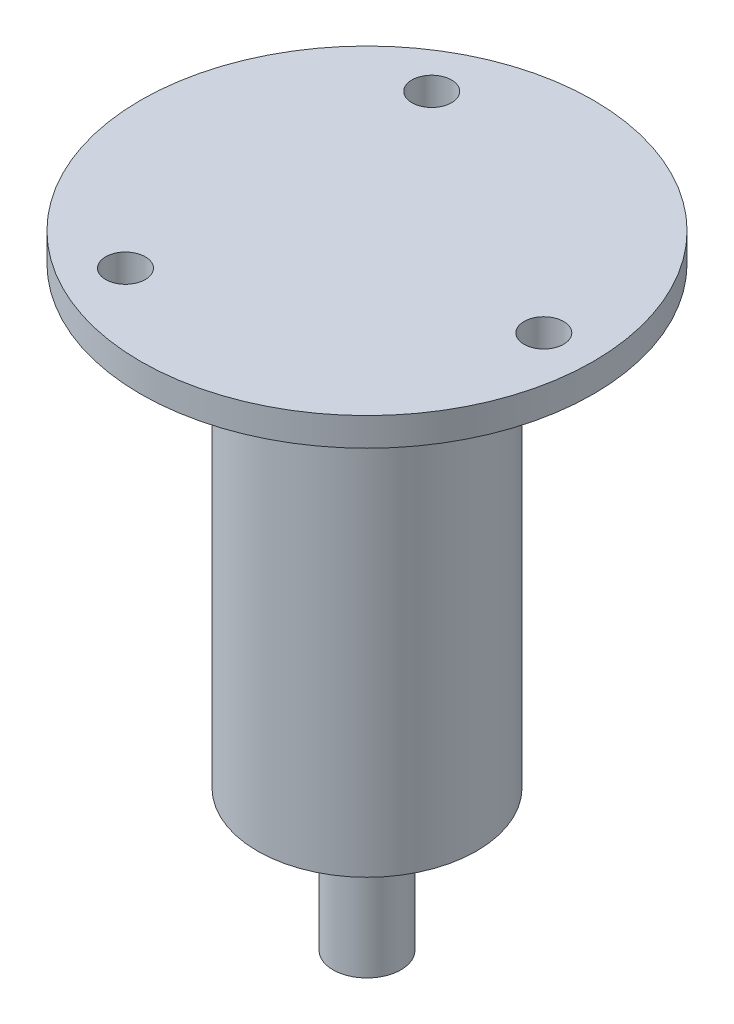
ISO-10303-21;
HEADER;
FILE_DESCRIPTION(('STEP AP214'),'2;1');
FILE_NAME('part.step','',(''),(''),'','','');
FILE_SCHEMA(('AUTOMOTIVE_DESIGN { 1 0 10303 214 1 1 1 1 }'));
ENDSEC;
DATA;
#1=APPLICATION_CONTEXT('core data for automotive mechanical design processes');
#2=APPLICATION_PROTOCOL_DEFINITION('international standard','automotive_design',2000,#1);
#3=PRODUCT_CONTEXT('',#1,'mechanical');
#4=PRODUCT('Part','Part','',(#3));
#5=PRODUCT_RELATED_PRODUCT_CATEGORY('part','',(#4));
#6=PRODUCT_DEFINITION_FORMATION('','',#4);
#7=PRODUCT_DEFINITION_CONTEXT('part definition',#1,'design');
#8=PRODUCT_DEFINITION('design','',#6,#7);
#9=PRODUCT_DEFINITION_SHAPE('','',#8);
#10=(LENGTH_UNIT() NAMED_UNIT(*) SI_UNIT(.MILLI.,.METRE.));
#11=(NAMED_UNIT(*) PLANE_ANGLE_UNIT() SI_UNIT($,.RADIAN.));
#12=(NAMED_UNIT(*) SI_UNIT($,.STERADIAN.) SOLID_ANGLE_UNIT());
#13=UNCERTAINTY_MEASURE_WITH_UNIT(LENGTH_MEASURE(1.E-05),#10,'distance_accuracy_value','');
#14=(GEOMETRIC_REPRESENTATION_CONTEXT(3) GLOBAL_UNCERTAINTY_ASSIGNED_CONTEXT((#13)) GLOBAL_UNIT_ASSIGNED_CONTEXT((#10,
#11,#12)) REPRESENTATION_CONTEXT('',''));
#15=CARTESIAN_POINT('',(0.,0.,0.));
#16=DIRECTION('',(0.,0.,1.));
#17=DIRECTION('',(1.,0.,0.));
#18=AXIS2_PLACEMENT_3D('',#15,#16,#17);
#19=CARTESIAN_POINT('',(0.,14.05,16.));
#20=DIRECTION('',(0.,1.,0.));
#21=DIRECTION('',(0.,0.,1.));
#22=AXIS2_PLACEMENT_3D('',#19,#20,#21);
#23=PLANE('',#22);
#24=CARTESIAN_POINT('',(12.5,14.05,0.));
#25=DIRECTION('',(0.,1.,0.));
#26=DIRECTION('',(0.,0.,1.));
#27=AXIS2_PLACEMENT_3D('',#24,#25,#26);
#28=CIRCLE('',#27,1.4);
#29=CARTESIAN_POINT('',(12.5,14.05,1.39999999999999));
#30=VERTEX_POINT('',#29);
#31=EDGE_CURVE('E63',#30,#30,#28,.T.);
#32=ORIENTED_EDGE('',*,*,#31,.F.);
#33=EDGE_LOOP('',(#32));
#34=FACE_BOUND('',#33,.T.);
#35=CARTESIAN_POINT('',(-6.24999999999998,14.05,10.8253175473055));
#36=DIRECTION('',(0.,1.,0.));
#37=DIRECTION('',(0.,0.,1.));
#38=AXIS2_PLACEMENT_3D('',#35,#36,#37);
#39=CIRCLE('',#38,1.4);
#40=CARTESIAN_POINT('',(-6.24999999999998,14.05,12.2253175473055));
#41=VERTEX_POINT('',#40);
#42=EDGE_CURVE('E50',#41,#41,#39,.T.);
#43=ORIENTED_EDGE('',*,*,#42,.F.);
#44=EDGE_LOOP('',(#43));
#45=FACE_BOUND('',#44,.T.);
#46=CARTESIAN_POINT('',(-6.25000000000001,14.05,-10.8253175473055));
#47=DIRECTION('',(0.,1.,0.));
#48=DIRECTION('',(0.,0.,1.));
#49=AXIS2_PLACEMENT_3D('',#46,#47,#48);
#50=CIRCLE('',#49,1.4);
#51=CARTESIAN_POINT('',(-6.25000000000001,14.05,-9.42531754730548));
#52=VERTEX_POINT('',#51);
#53=EDGE_CURVE('E45',#52,#52,#50,.T.);
#54=ORIENTED_EDGE('',*,*,#53,.F.);
#55=EDGE_LOOP('',(#54));
#56=FACE_BOUND('',#55,.T.);
#57=CARTESIAN_POINT('',(0.,14.05,0.));
#58=DIRECTION('',(0.,1.,0.));
#59=DIRECTION('',(0.,0.,1.));
#60=AXIS2_PLACEMENT_3D('',#57,#58,#59);
#61=CIRCLE('',#60,16.);
#62=CARTESIAN_POINT('',(0.,14.05,16.));
#63=VERTEX_POINT('',#62);
#64=EDGE_CURVE('E64',#63,#63,#61,.T.);
#65=ORIENTED_EDGE('',*,*,#64,.T.);
#66=EDGE_LOOP('',(#65));
#67=FACE_BOUND('',#66,.T.);
#68=ADVANCED_FACE('F35',(#34,#45,#56,#67),#23,.T.);
#69=CARTESIAN_POINT('',(0.,-30.,0.));
#70=DIRECTION('',(0.,1.,0.));
#71=DIRECTION('',(0.,0.,1.));
#72=AXIS2_PLACEMENT_3D('',#69,#70,#71);
#73=PLANE('',#72);
#74=CARTESIAN_POINT('',(0.,-30.,0.));
#75=DIRECTION('',(0.,1.,0.));
#76=DIRECTION('',(0.,0.,1.));
#77=AXIS2_PLACEMENT_3D('',#74,#75,#76);
#78=CIRCLE('',#77,2.4);
#79=CARTESIAN_POINT('',(0.,-30.,2.4));
#80=VERTEX_POINT('',#79);
#81=EDGE_CURVE('E11',#80,#80,#78,.T.);
#82=ORIENTED_EDGE('',*,*,#81,.F.);
#83=EDGE_LOOP('',(#82));
#84=FACE_BOUND('',#83,.T.);
#85=ADVANCED_FACE('F84',(#84),#73,.F.);
#86=CARTESIAN_POINT('',(0.,-30.,0.));
#87=DIRECTION('',(0.,1.,0.));
#88=DIRECTION('',(0.,0.,1.));
#89=AXIS2_PLACEMENT_3D('',#86,#87,#88);
#90=CYLINDRICAL_SURFACE('',#89,2.4);
#91=ORIENTED_EDGE('',*,*,#81,.T.);
#92=EDGE_LOOP('',(#91));
#93=FACE_BOUND('',#92,.T.);
#94=CARTESIAN_POINT('',(0.,-20.05,0.));
#95=DIRECTION('',(0.,1.,0.));
#96=DIRECTION('',(0.,0.,1.));
#97=AXIS2_PLACEMENT_3D('',#94,#95,#96);
#98=CIRCLE('',#97,2.4);
#99=CARTESIAN_POINT('',(0.,-20.05,2.4));
#100=VERTEX_POINT('',#99);
#101=EDGE_CURVE('E41',#100,#100,#98,.T.);
#102=ORIENTED_EDGE('',*,*,#101,.F.);
#103=EDGE_LOOP('',(#102));
#104=FACE_BOUND('',#103,.T.);
#105=ADVANCED_FACE('F113',(#93,#104),#90,.T.);
#106=CARTESIAN_POINT('',(0.,-20.05,-7.75000000000001));
#107=DIRECTION('',(0.,1.,0.));
#108=DIRECTION('',(0.,0.,1.));
#109=AXIS2_PLACEMENT_3D('',#106,#107,#108);
#110=PLANE('',#109);
#111=ORIENTED_EDGE('',*,*,#101,.T.);
#112=EDGE_LOOP('',(#111));
#113=FACE_BOUND('',#112,.T.);
#114=CARTESIAN_POINT('',(0.,-20.05,0.));
#115=DIRECTION('',(0.,1.,0.));
#116=DIRECTION('',(0.,0.,1.));
#117=AXIS2_PLACEMENT_3D('',#114,#115,#116);
#118=CIRCLE('',#117,7.75000000000001);
#119=CARTESIAN_POINT('',(0.,-20.05,7.75000000000001));
#120=VERTEX_POINT('',#119);
#121=EDGE_CURVE('E57',#120,#120,#118,.T.);
#122=ORIENTED_EDGE('',*,*,#121,.F.);
#123=EDGE_LOOP('',(#122));
#124=FACE_BOUND('',#123,.T.);
#125=ADVANCED_FACE('F108',(#113,#124),#110,.F.);
#126=CARTESIAN_POINT('',(0.,23.9311224489796,0.));
#127=DIRECTION('',(0.,1.,0.));
#128=DIRECTION('',(0.,0.,1.));
#129=AXIS2_PLACEMENT_3D('',#126,#127,#128);
#130=CYLINDRICAL_SURFACE('',#129,7.75);
#131=CARTESIAN_POINT('',(0.,12.05,0.));
#132=DIRECTION('',(0.,1.,0.));
#133=DIRECTION('',(0.,0.,1.));
#134=AXIS2_PLACEMENT_3D('',#131,#132,#133);
#135=CIRCLE('',#134,7.75);
#136=CARTESIAN_POINT('',(0.,12.05,7.75));
#137=VERTEX_POINT('',#136);
#138=EDGE_CURVE('E70',#137,#137,#135,.T.);
#139=ORIENTED_EDGE('',*,*,#138,.F.);
#140=EDGE_LOOP('',(#139));
#141=FACE_BOUND('',#140,.T.);
#142=ORIENTED_EDGE('',*,*,#121,.T.);
#143=EDGE_LOOP('',(#142));
#144=FACE_BOUND('',#143,.T.);
#145=ADVANCED_FACE('F101',(#141,#144),#130,.T.);
#146=CARTESIAN_POINT('',(0.,12.05,-16.));
#147=DIRECTION('',(0.,1.,0.));
#148=DIRECTION('',(0.,0.,1.));
#149=AXIS2_PLACEMENT_3D('',#146,#147,#148);
#150=PLANE('',#149);
#151=CARTESIAN_POINT('',(12.5,12.05,0.));
#152=DIRECTION('',(0.,1.,0.));
#153=DIRECTION('',(0.,0.,1.));
#154=AXIS2_PLACEMENT_3D('',#151,#152,#153);
#155=CIRCLE('',#154,1.4);
#156=CARTESIAN_POINT('',(12.5,12.05,1.39999999999999));
#157=VERTEX_POINT('',#156);
#158=EDGE_CURVE('E53',#157,#157,#155,.T.);
#159=ORIENTED_EDGE('',*,*,#158,.T.);
#160=EDGE_LOOP('',(#159));
#161=FACE_BOUND('',#160,.T.);
#162=CARTESIAN_POINT('',(-6.24999999999998,12.05,10.8253175473055));
#163=DIRECTION('',(0.,1.,0.));
#164=DIRECTION('',(0.,0.,1.));
#165=AXIS2_PLACEMENT_3D('',#162,#163,#164);
#166=CIRCLE('',#165,1.4);
#167=CARTESIAN_POINT('',(-6.24999999999998,12.05,12.2253175473055));
#168=VERTEX_POINT('',#167);
#169=EDGE_CURVE('E56',#168,#168,#166,.T.);
#170=ORIENTED_EDGE('',*,*,#169,.T.);
#171=EDGE_LOOP('',(#170));
#172=FACE_BOUND('',#171,.T.);
#173=CARTESIAN_POINT('',(-6.25000000000001,12.05,-10.8253175473055));
#174=DIRECTION('',(0.,1.,0.));
#175=DIRECTION('',(0.,0.,1.));
#176=AXIS2_PLACEMENT_3D('',#173,#174,#175);
#177=CIRCLE('',#176,1.4);
#178=CARTESIAN_POINT('',(-6.25000000000001,12.05,-9.42531754730548));
#179=VERTEX_POINT('',#178);
#180=EDGE_CURVE('E60',#179,#179,#177,.T.);
#181=ORIENTED_EDGE('',*,*,#180,.T.);
#182=EDGE_LOOP('',(#181));
#183=FACE_BOUND('',#182,.T.);
#184=CARTESIAN_POINT('',(0.,12.05,0.));
#185=DIRECTION('',(0.,1.,0.));
#186=DIRECTION('',(0.,0.,1.));
#187=AXIS2_PLACEMENT_3D('',#184,#185,#186);
#188=CIRCLE('',#187,16.);
#189=CARTESIAN_POINT('',(0.,12.05,16.));
#190=VERTEX_POINT('',#189);
#191=EDGE_CURVE('E67',#190,#190,#188,.T.);
#192=ORIENTED_EDGE('',*,*,#191,.F.);
#193=EDGE_LOOP('',(#192));
#194=FACE_BOUND('',#193,.T.);
#195=ORIENTED_EDGE('',*,*,#138,.T.);
#196=EDGE_LOOP('',(#195));
#197=FACE_BOUND('',#196,.T.);
#198=ADVANCED_FACE('F98',(#161,#172,#183,#194,#197),#150,.F.);
#199=CARTESIAN_POINT('',(12.5,-20.05,0.));
#200=DIRECTION('',(0.,1.,0.));
#201=DIRECTION('',(0.,0.,1.));
#202=AXIS2_PLACEMENT_3D('',#199,#200,#201);
#203=CYLINDRICAL_SURFACE('',#202,1.4);
#204=ORIENTED_EDGE('',*,*,#31,.T.);
#205=EDGE_LOOP('',(#204));
#206=FACE_BOUND('',#205,.T.);
#207=ORIENTED_EDGE('',*,*,#158,.F.);
#208=EDGE_LOOP('',(#207));
#209=FACE_BOUND('',#208,.T.);
#210=ADVANCED_FACE('F79',(#206,#209),#203,.F.);
#211=CARTESIAN_POINT('',(-6.24999999999998,-20.05,10.8253175473055));
#212=DIRECTION('',(0.,1.,0.));
#213=DIRECTION('',(0.,0.,1.));
#214=AXIS2_PLACEMENT_3D('',#211,#212,#213);
#215=CYLINDRICAL_SURFACE('',#214,1.4);
#216=ORIENTED_EDGE('',*,*,#42,.T.);
#217=EDGE_LOOP('',(#216));
#218=FACE_BOUND('',#217,.T.);
#219=ORIENTED_EDGE('',*,*,#169,.F.);
#220=EDGE_LOOP('',(#219));
#221=FACE_BOUND('',#220,.T.);
#222=ADVANCED_FACE('F127',(#218,#221),#215,.F.);
#223=CARTESIAN_POINT('',(-6.25000000000001,-20.05,-10.8253175473055));
#224=DIRECTION('',(0.,1.,0.));
#225=DIRECTION('',(0.,0.,1.));
#226=AXIS2_PLACEMENT_3D('',#223,#224,#225);
#227=CYLINDRICAL_SURFACE('',#226,1.4);
#228=ORIENTED_EDGE('',*,*,#53,.T.);
#229=EDGE_LOOP('',(#228));
#230=FACE_BOUND('',#229,.T.);
#231=ORIENTED_EDGE('',*,*,#180,.F.);
#232=EDGE_LOOP('',(#231));
#233=FACE_BOUND('',#232,.T.);
#234=ADVANCED_FACE('F94',(#230,#233),#227,.F.);
#235=CARTESIAN_POINT('',(0.,23.9311224489796,0.));
#236=DIRECTION('',(0.,1.,0.));
#237=DIRECTION('',(0.,0.,1.));
#238=AXIS2_PLACEMENT_3D('',#235,#236,#237);
#239=CYLINDRICAL_SURFACE('',#238,16.);
#240=ORIENTED_EDGE('',*,*,#64,.F.);
#241=EDGE_LOOP('',(#240));
#242=FACE_BOUND('',#241,.T.);
#243=ORIENTED_EDGE('',*,*,#191,.T.);
#244=EDGE_LOOP('',(#243));
#245=FACE_BOUND('',#244,.T.);
#246=ADVANCED_FACE('F85',(#242,#245),#239,.T.);
#247=CLOSED_SHELL('',(#68,#85,#105,#125,#145,#198,#210,#222,#234,#246));
#248=MANIFOLD_SOLID_BREP('B2',#247);
#249=ADVANCED_BREP_SHAPE_REPRESENTATION('',(#18,#248),#14);
#250=SHAPE_DEFINITION_REPRESENTATION(#9,#249);
ENDSEC;
END-ISO-10303-21;
